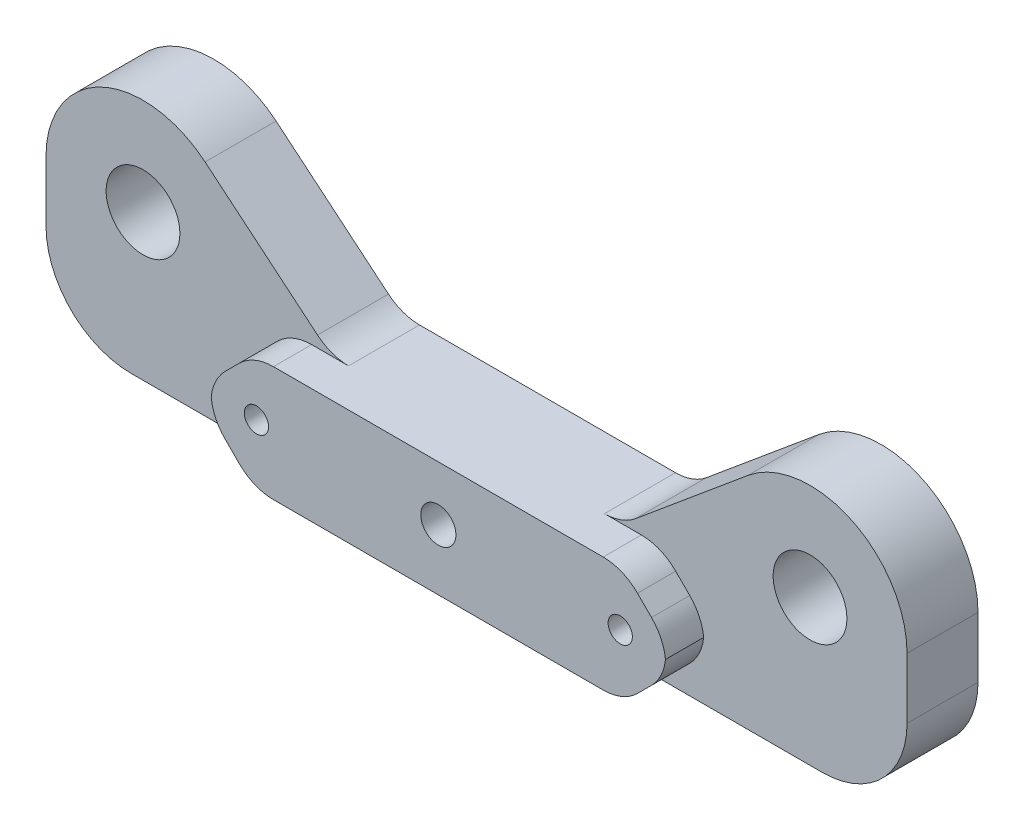
ISO-10303-21;
HEADER;
FILE_DESCRIPTION(('STEP AP214'),'2;1');
FILE_NAME('part.step','',(''),(''),'','','');
FILE_SCHEMA(('AUTOMOTIVE_DESIGN { 1 0 10303 214 1 1 1 1 }'));
ENDSEC;
DATA;
#1=APPLICATION_CONTEXT('core data for automotive mechanical design processes');
#2=APPLICATION_PROTOCOL_DEFINITION('international standard','automotive_design',2000,#1);
#3=PRODUCT_CONTEXT('',#1,'mechanical');
#4=PRODUCT('Part','Part','',(#3));
#5=PRODUCT_RELATED_PRODUCT_CATEGORY('part','',(#4));
#6=PRODUCT_DEFINITION_FORMATION('','',#4);
#7=PRODUCT_DEFINITION_CONTEXT('part definition',#1,'design');
#8=PRODUCT_DEFINITION('design','',#6,#7);
#9=PRODUCT_DEFINITION_SHAPE('','',#8);
#10=(LENGTH_UNIT() NAMED_UNIT(*) SI_UNIT(.MILLI.,.METRE.));
#11=(NAMED_UNIT(*) PLANE_ANGLE_UNIT() SI_UNIT($,.RADIAN.));
#12=(NAMED_UNIT(*) SI_UNIT($,.STERADIAN.) SOLID_ANGLE_UNIT());
#13=UNCERTAINTY_MEASURE_WITH_UNIT(LENGTH_MEASURE(1.E-05),#10,'distance_accuracy_value','');
#14=(GEOMETRIC_REPRESENTATION_CONTEXT(3) GLOBAL_UNCERTAINTY_ASSIGNED_CONTEXT((#13)) GLOBAL_UNIT_ASSIGNED_CONTEXT((#10,
#11,#12)) REPRESENTATION_CONTEXT('',''));
#15=CARTESIAN_POINT('',(0.,0.,0.));
#16=DIRECTION('',(0.,0.,1.));
#17=DIRECTION('',(1.,0.,0.));
#18=AXIS2_PLACEMENT_3D('',#15,#16,#17);
#19=CARTESIAN_POINT('',(15.,0.,-9.));
#20=DIRECTION('',(0.,0.,-1.));
#21=DIRECTION('',(1.,0.,0.));
#22=AXIS2_PLACEMENT_3D('',#19,#20,#21);
#23=CYLINDRICAL_SURFACE('',#22,0.999999999999997);
#24=CARTESIAN_POINT('',(15.,0.,0.));
#25=DIRECTION('',(0.,0.,-1.));
#26=DIRECTION('',(-1.,0.,0.));
#27=AXIS2_PLACEMENT_3D('',#24,#25,#26);
#28=CIRCLE('',#27,0.999999999999997);
#29=CARTESIAN_POINT('',(14.,0.,0.));
#30=VERTEX_POINT('',#29);
#31=EDGE_CURVE('E293',#30,#30,#28,.T.);
#32=ORIENTED_EDGE('',*,*,#31,.F.);
#33=EDGE_LOOP('',(#32));
#34=FACE_BOUND('',#33,.T.);
#35=CARTESIAN_POINT('',(15.,0.,-7.));
#36=DIRECTION('',(0.,0.,1.));
#37=DIRECTION('',(1.,0.,0.));
#38=AXIS2_PLACEMENT_3D('',#35,#36,#37);
#39=CIRCLE('',#38,0.999999999999997);
#40=CARTESIAN_POINT('',(16.,0.,-7.));
#41=VERTEX_POINT('',#40);
#42=EDGE_CURVE('E335',#41,#41,#39,.F.);
#43=ORIENTED_EDGE('',*,*,#42,.T.);
#44=EDGE_LOOP('',(#43));
#45=FACE_BOUND('',#44,.T.);
#46=ADVANCED_FACE('F39',(#34,#45),#23,.F.);
#47=CARTESIAN_POINT('',(-15.,0.,-9.));
#48=DIRECTION('',(0.,0.,-1.));
#49=DIRECTION('',(1.,0.,0.));
#50=AXIS2_PLACEMENT_3D('',#47,#48,#49);
#51=CYLINDRICAL_SURFACE('',#50,0.999999999999994);
#52=CARTESIAN_POINT('',(-15.,0.,0.));
#53=DIRECTION('',(0.,0.,-1.));
#54=DIRECTION('',(-1.,0.,0.));
#55=AXIS2_PLACEMENT_3D('',#52,#53,#54);
#56=CIRCLE('',#55,0.999999999999994);
#57=CARTESIAN_POINT('',(-16.,0.,0.));
#58=VERTEX_POINT('',#57);
#59=EDGE_CURVE('E296',#58,#58,#56,.T.);
#60=ORIENTED_EDGE('',*,*,#59,.F.);
#61=EDGE_LOOP('',(#60));
#62=FACE_BOUND('',#61,.T.);
#63=CARTESIAN_POINT('',(-15.,0.,-7.));
#64=DIRECTION('',(0.,0.,1.));
#65=DIRECTION('',(1.,0.,0.));
#66=AXIS2_PLACEMENT_3D('',#63,#64,#65);
#67=CIRCLE('',#66,0.999999999999994);
#68=CARTESIAN_POINT('',(-14.,0.,-7.));
#69=VERTEX_POINT('',#68);
#70=EDGE_CURVE('E332',#69,#69,#67,.F.);
#71=ORIENTED_EDGE('',*,*,#70,.T.);
#72=EDGE_LOOP('',(#71));
#73=FACE_BOUND('',#72,.T.);
#74=ADVANCED_FACE('F539',(#62,#73),#51,.F.);
#75=CARTESIAN_POINT('',(33.75,-3.5,-3.15));
#76=DIRECTION('',(0.,0.,-1.));
#77=DIRECTION('',(1.,0.,0.));
#78=AXIS2_PLACEMENT_3D('',#75,#76,#77);
#79=PLANE('',#78);
#80=DIRECTION('',(0.,-1.,0.));
#81=VECTOR('',#80,1.);
#82=CARTESIAN_POINT('',(35.5,7.,-3.15000000000001));
#83=LINE('',#82,#81);
#84=CARTESIAN_POINT('',(35.5,7.,-3.15000000000001));
#85=VERTEX_POINT('',#84);
#86=CARTESIAN_POINT('',(35.5,2.,-3.15000000000001));
#87=VERTEX_POINT('',#86);
#88=EDGE_CURVE('E454',#85,#87,#83,.T.);
#89=ORIENTED_EDGE('',*,*,#88,.F.);
#90=CARTESIAN_POINT('',(27.5,7.,-3.15));
#91=DIRECTION('',(0.,0.,-1.));
#92=DIRECTION('',(-1.,0.,0.));
#93=AXIS2_PLACEMENT_3D('',#90,#91,#92);
#94=CIRCLE('',#93,8.);
#95=CARTESIAN_POINT('',(22.3795735427094,13.1466440352015,-3.15));
#96=VERTEX_POINT('',#95);
#97=EDGE_CURVE('E250',#96,#85,#94,.T.);
#98=ORIENTED_EDGE('',*,*,#97,.F.);
#99=DIRECTION('',(0.768330504400193,0.640053307161321,0.));
#100=VECTOR('',#99,1.);
#101=CARTESIAN_POINT('',(22.3795735427094,13.1466440352015,-3.15));
#102=LINE('',#101,#100);
#103=CARTESIAN_POINT('',(13.1123994730862,5.42667798239923,-3.14999999999999));
#104=VERTEX_POINT('',#103);
#105=EDGE_CURVE('E235',#104,#96,#102,.T.);
#106=ORIENTED_EDGE('',*,*,#105,.F.);
#107=CARTESIAN_POINT('',(10.5521862444409,8.5,-3.14999999999999));
#108=DIRECTION('',(0.,0.,1.));
#109=DIRECTION('',(1.,0.,0.));
#110=AXIS2_PLACEMENT_3D('',#107,#108,#109);
#111=CIRCLE('',#110,4.);
#112=CARTESIAN_POINT('',(10.5521862444409,4.5,-3.14999999999999));
#113=VERTEX_POINT('',#112);
#114=EDGE_CURVE('E350',#113,#104,#111,.T.);
#115=ORIENTED_EDGE('',*,*,#114,.F.);
#116=DIRECTION('',(-1.,0.,0.));
#117=VECTOR('',#116,1.);
#118=CARTESIAN_POINT('',(18.75,4.5,-3.15));
#119=LINE('',#118,#117);
#120=CARTESIAN_POINT('',(13.5931457505076,4.5,-3.14999999999999));
#121=VERTEX_POINT('',#120);
#122=EDGE_CURVE('E303',#121,#113,#119,.T.);
#123=ORIENTED_EDGE('',*,*,#122,.F.);
#124=CARTESIAN_POINT('',(13.5931457505076,0.500000000000002,-3.14999999999999));
#125=DIRECTION('',(0.,0.,1.));
#126=DIRECTION('',(1.,0.,0.));
#127=AXIS2_PLACEMENT_3D('',#124,#125,#126);
#128=CIRCLE('',#127,4.);
#129=CARTESIAN_POINT('',(16.4215728752538,3.32842712474619,-3.14999999999999));
#130=VERTEX_POINT('',#129);
#131=EDGE_CURVE('E11',#130,#121,#128,.T.);
#132=ORIENTED_EDGE('',*,*,#131,.F.);
#133=DIRECTION('',(-0.707106781186547,0.707106781186548,0.));
#134=VECTOR('',#133,1.);
#135=CARTESIAN_POINT('',(28.5,-8.75000000000001,-3.15));
#136=LINE('',#135,#134);
#137=CARTESIAN_POINT('',(17.5784271247462,2.1715728752538,-3.15));
#138=VERTEX_POINT('',#137);
#139=EDGE_CURVE('E329',#138,#130,#136,.T.);
#140=ORIENTED_EDGE('',*,*,#139,.F.);
#141=CARTESIAN_POINT('',(14.75,-0.656854249492387,-3.14999999999999));
#142=DIRECTION('',(0.,0.,1.));
#143=DIRECTION('',(1.,0.,0.));
#144=AXIS2_PLACEMENT_3D('',#141,#142,#143);
#145=CIRCLE('',#144,4.);
#146=CARTESIAN_POINT('',(18.7292549076014,-0.249999999999993,-3.15));
#147=VERTEX_POINT('',#146);
#148=EDGE_CURVE('E48',#147,#138,#145,.T.);
#149=ORIENTED_EDGE('',*,*,#148,.F.);
#150=CARTESIAN_POINT('',(14.75,0.156854249492402,-3.14999999999999));
#151=DIRECTION('',(0.,0.,1.));
#152=DIRECTION('',(1.,0.,0.));
#153=AXIS2_PLACEMENT_3D('',#150,#151,#152);
#154=CIRCLE('',#153,4.);
#155=CARTESIAN_POINT('',(17.5784271247462,-2.67157287525378,-3.15));
#156=VERTEX_POINT('',#155);
#157=EDGE_CURVE('E435',#156,#147,#154,.T.);
#158=ORIENTED_EDGE('',*,*,#157,.F.);
#159=DIRECTION('',(0.707106781186546,0.707106781186549,0.));
#160=VECTOR('',#159,1.);
#161=CARTESIAN_POINT('',(25.25,5.00000000000001,-3.15));
#162=LINE('',#161,#160);
#163=CARTESIAN_POINT('',(16.4215728752538,-3.82842712474618,-3.14999999999999));
#164=VERTEX_POINT('',#163);
#165=EDGE_CURVE('E323',#164,#156,#162,.T.);
#166=ORIENTED_EDGE('',*,*,#165,.F.);
#167=CARTESIAN_POINT('',(13.5931457505076,-0.999999999999997,-3.14999999999999));
#168=DIRECTION('',(0.,0.,1.));
#169=DIRECTION('',(1.,0.,0.));
#170=AXIS2_PLACEMENT_3D('',#167,#168,#169);
#171=CIRCLE('',#170,4.);
#172=CARTESIAN_POINT('',(13.5931457505076,-5.,-3.14999999999999));
#173=VERTEX_POINT('',#172);
#174=EDGE_CURVE('E432',#173,#164,#171,.T.);
#175=ORIENTED_EDGE('',*,*,#174,.F.);
#176=DIRECTION('',(1.,0.,0.));
#177=VECTOR('',#176,1.);
#178=CARTESIAN_POINT('',(18.75,-5.,-3.15));
#179=LINE('',#178,#177);
#180=CARTESIAN_POINT('',(28.5,-5.,-3.15));
#181=VERTEX_POINT('',#180);
#182=EDGE_CURVE('E279',#173,#181,#179,.T.);
#183=ORIENTED_EDGE('',*,*,#182,.T.);
#184=CARTESIAN_POINT('',(28.5,2.,-3.15));
#185=DIRECTION('',(0.,0.,1.));
#186=DIRECTION('',(1.,0.,0.));
#187=AXIS2_PLACEMENT_3D('',#184,#185,#186);
#188=CIRCLE('',#187,7.);
#189=EDGE_CURVE('E358',#87,#181,#188,.F.);
#190=ORIENTED_EDGE('',*,*,#189,.F.);
#191=EDGE_LOOP('',(#89,#98,#106,#115,#123,#132,#140,#149,#158,#166,#175,#183,#190));
#192=FACE_BOUND('',#191,.T.);
#193=CARTESIAN_POINT('',(27.5,7.,-3.15));
#194=DIRECTION('',(0.,0.,1.));
#195=DIRECTION('',(1.,0.,0.));
#196=AXIS2_PLACEMENT_3D('',#193,#194,#195);
#197=CIRCLE('',#196,3.04);
#198=CARTESIAN_POINT('',(30.54,7.,-3.15));
#199=VERTEX_POINT('',#198);
#200=EDGE_CURVE('E299',#199,#199,#197,.F.);
#201=ORIENTED_EDGE('',*,*,#200,.T.);
#202=EDGE_LOOP('',(#201));
#203=FACE_BOUND('',#202,.T.);
#204=ADVANCED_FACE('F503',(#192,#203),#79,.F.);
#205=CARTESIAN_POINT('',(-33.75,3.5,-9.));
#206=DIRECTION('',(0.,0.,-1.));
#207=DIRECTION('',(1.,0.,0.));
#208=AXIS2_PLACEMENT_3D('',#205,#206,#207);
#209=PLANE('',#208);
#210=DIRECTION('',(-1.,0.,0.));
#211=VECTOR('',#210,1.);
#212=CARTESIAN_POINT('',(33.75,-5.,-9.));
#213=LINE('',#212,#211);
#214=CARTESIAN_POINT('',(28.5,-5.,-9.));
#215=VERTEX_POINT('',#214);
#216=CARTESIAN_POINT('',(-28.5,-5.,-9.));
#217=VERTEX_POINT('',#216);
#218=EDGE_CURVE('E282',#215,#217,#213,.T.);
#219=ORIENTED_EDGE('',*,*,#218,.T.);
#220=CARTESIAN_POINT('',(-28.5,2.,-9.));
#221=DIRECTION('',(0.,0.,1.));
#222=DIRECTION('',(1.,0.,0.));
#223=AXIS2_PLACEMENT_3D('',#220,#221,#222);
#224=CIRCLE('',#223,7.);
#225=CARTESIAN_POINT('',(-35.5,2.,-9.));
#226=VERTEX_POINT('',#225);
#227=EDGE_CURVE('E365',#226,#217,#224,.T.);
#228=ORIENTED_EDGE('',*,*,#227,.F.);
#229=DIRECTION('',(0.,1.,0.));
#230=VECTOR('',#229,1.);
#231=CARTESIAN_POINT('',(-35.5,7.,-9.));
#232=LINE('',#231,#230);
#233=CARTESIAN_POINT('',(-35.5,7.,-9.));
#234=VERTEX_POINT('',#233);
#235=EDGE_CURVE('E242',#226,#234,#232,.T.);
#236=ORIENTED_EDGE('',*,*,#235,.T.);
#237=CARTESIAN_POINT('',(-27.5,7.,-9.));
#238=DIRECTION('',(0.,0.,1.));
#239=DIRECTION('',(1.,0.,0.));
#240=AXIS2_PLACEMENT_3D('',#237,#238,#239);
#241=CIRCLE('',#240,8.);
#242=CARTESIAN_POINT('',(-22.3795735427095,13.1466440352015,-9.));
#243=VERTEX_POINT('',#242);
#244=EDGE_CURVE('E219',#234,#243,#241,.F.);
#245=ORIENTED_EDGE('',*,*,#244,.T.);
#246=DIRECTION('',(0.768330504400194,-0.640053307161321,0.));
#247=VECTOR('',#246,1.);
#248=CARTESIAN_POINT('',(-22.3795735427095,13.1466440352016,-9.));
#249=LINE('',#248,#247);
#250=CARTESIAN_POINT('',(-13.1123994730862,5.42667798239922,-9.));
#251=VERTEX_POINT('',#250);
#252=EDGE_CURVE('E226',#243,#251,#249,.T.);
#253=ORIENTED_EDGE('',*,*,#252,.T.);
#254=CARTESIAN_POINT('',(-10.5521862444409,8.5,-9.));
#255=DIRECTION('',(0.,0.,1.));
#256=DIRECTION('',(1.,0.,0.));
#257=AXIS2_PLACEMENT_3D('',#254,#255,#256);
#258=CIRCLE('',#257,4.);
#259=CARTESIAN_POINT('',(-10.5521862444409,4.5,-9.));
#260=VERTEX_POINT('',#259);
#261=EDGE_CURVE('E348',#260,#251,#258,.F.);
#262=ORIENTED_EDGE('',*,*,#261,.F.);
#263=DIRECTION('',(1.,0.,0.));
#264=VECTOR('',#263,1.);
#265=CARTESIAN_POINT('',(-21.25,4.5,-9.));
#266=LINE('',#265,#264);
#267=CARTESIAN_POINT('',(10.5521862444409,4.5,-9.));
#268=VERTEX_POINT('',#267);
#269=EDGE_CURVE('E261',#260,#268,#266,.T.);
#270=ORIENTED_EDGE('',*,*,#269,.T.);
#271=CARTESIAN_POINT('',(10.5521862444409,8.5,-9.));
#272=DIRECTION('',(0.,0.,1.));
#273=DIRECTION('',(1.,0.,0.));
#274=AXIS2_PLACEMENT_3D('',#271,#272,#273);
#275=CIRCLE('',#274,4.);
#276=CARTESIAN_POINT('',(13.1123994730862,5.42667798239923,-9.));
#277=VERTEX_POINT('',#276);
#278=EDGE_CURVE('E353',#277,#268,#275,.F.);
#279=ORIENTED_EDGE('',*,*,#278,.F.);
#280=DIRECTION('',(0.768330504400193,0.640053307161321,0.));
#281=VECTOR('',#280,1.);
#282=CARTESIAN_POINT('',(22.3795735427094,13.1466440352015,-9.));
#283=LINE('',#282,#281);
#284=CARTESIAN_POINT('',(22.3795735427094,13.1466440352015,-9.));
#285=VERTEX_POINT('',#284);
#286=EDGE_CURVE('E443',#277,#285,#283,.T.);
#287=ORIENTED_EDGE('',*,*,#286,.T.);
#288=CARTESIAN_POINT('',(27.5,7.,-9.));
#289=DIRECTION('',(0.,0.,1.));
#290=DIRECTION('',(1.,0.,0.));
#291=AXIS2_PLACEMENT_3D('',#288,#289,#290);
#292=CIRCLE('',#291,8.);
#293=CARTESIAN_POINT('',(35.5,7.,-9.));
#294=VERTEX_POINT('',#293);
#295=EDGE_CURVE('E245',#285,#294,#292,.F.);
#296=ORIENTED_EDGE('',*,*,#295,.T.);
#297=DIRECTION('',(0.,-1.,0.));
#298=VECTOR('',#297,1.);
#299=CARTESIAN_POINT('',(35.5,7.,-9.));
#300=LINE('',#299,#298);
#301=CARTESIAN_POINT('',(35.5,2.,-9.));
#302=VERTEX_POINT('',#301);
#303=EDGE_CURVE('E247',#294,#302,#300,.T.);
#304=ORIENTED_EDGE('',*,*,#303,.T.);
#305=CARTESIAN_POINT('',(28.5,2.,-9.));
#306=DIRECTION('',(0.,0.,1.));
#307=DIRECTION('',(1.,0.,0.));
#308=AXIS2_PLACEMENT_3D('',#305,#306,#307);
#309=CIRCLE('',#308,7.);
#310=EDGE_CURVE('E368',#215,#302,#309,.T.);
#311=ORIENTED_EDGE('',*,*,#310,.F.);
#312=EDGE_LOOP('',(#219,#228,#236,#245,#253,#262,#270,#279,#287,#296,#304,#311));
#313=FACE_BOUND('',#312,.T.);
#314=CARTESIAN_POINT('',(0.,0.,-9.));
#315=DIRECTION('',(0.,0.,1.));
#316=DIRECTION('',(1.,0.,0.));
#317=AXIS2_PLACEMENT_3D('',#314,#315,#316);
#318=CIRCLE('',#317,2.75);
#319=CARTESIAN_POINT('',(2.75,0.,-9.));
#320=VERTEX_POINT('',#319);
#321=EDGE_CURVE('E264',#320,#320,#318,.T.);
#322=ORIENTED_EDGE('',*,*,#321,.T.);
#323=EDGE_LOOP('',(#322));
#324=FACE_BOUND('',#323,.T.);
#325=CARTESIAN_POINT('',(27.5,7.,-9.));
#326=DIRECTION('',(0.,0.,1.));
#327=DIRECTION('',(1.,0.,0.));
#328=AXIS2_PLACEMENT_3D('',#325,#326,#327);
#329=CIRCLE('',#328,3.04);
#330=CARTESIAN_POINT('',(30.54,7.,-9.));
#331=VERTEX_POINT('',#330);
#332=EDGE_CURVE('E290',#331,#331,#329,.F.);
#333=ORIENTED_EDGE('',*,*,#332,.F.);
#334=EDGE_LOOP('',(#333));
#335=FACE_BOUND('',#334,.T.);
#336=CARTESIAN_POINT('',(-27.5,7.,-9.));
#337=DIRECTION('',(0.,0.,1.));
#338=DIRECTION('',(1.,0.,0.));
#339=AXIS2_PLACEMENT_3D('',#336,#337,#338);
#340=CIRCLE('',#339,3.04);
#341=CARTESIAN_POINT('',(-24.46,7.,-9.));
#342=VERTEX_POINT('',#341);
#343=EDGE_CURVE('E287',#342,#342,#340,.T.);
#344=ORIENTED_EDGE('',*,*,#343,.T.);
#345=EDGE_LOOP('',(#344));
#346=FACE_BOUND('',#345,.T.);
#347=ADVANCED_FACE('F238',(#313,#324,#335,#346),#209,.T.);
#348=CARTESIAN_POINT('',(-27.5,7.,-22.));
#349=DIRECTION('',(0.,0.,1.));
#350=DIRECTION('',(-1.,0.,0.));
#351=AXIS2_PLACEMENT_3D('',#348,#349,#350);
#352=CYLINDRICAL_SURFACE('',#351,3.04);
#353=CARTESIAN_POINT('',(-27.5,7.,-3.15));
#354=DIRECTION('',(0.,0.,1.));
#355=DIRECTION('',(1.,0.,0.));
#356=AXIS2_PLACEMENT_3D('',#353,#354,#355);
#357=CIRCLE('',#356,3.04);
#358=CARTESIAN_POINT('',(-24.46,7.,-3.15));
#359=VERTEX_POINT('',#358);
#360=EDGE_CURVE('E300',#359,#359,#357,.F.);
#361=ORIENTED_EDGE('',*,*,#360,.F.);
#362=EDGE_LOOP('',(#361));
#363=FACE_BOUND('',#362,.T.);
#364=ORIENTED_EDGE('',*,*,#343,.F.);
#365=EDGE_LOOP('',(#364));
#366=FACE_BOUND('',#365,.T.);
#367=ADVANCED_FACE('F558',(#363,#366),#352,.F.);
#368=CARTESIAN_POINT('',(27.5,7.,-22.));
#369=DIRECTION('',(0.,0.,1.));
#370=DIRECTION('',(-1.,0.,0.));
#371=AXIS2_PLACEMENT_3D('',#368,#369,#370);
#372=CYLINDRICAL_SURFACE('',#371,3.04);
#373=ORIENTED_EDGE('',*,*,#200,.F.);
#374=EDGE_LOOP('',(#373));
#375=FACE_BOUND('',#374,.T.);
#376=ORIENTED_EDGE('',*,*,#332,.T.);
#377=EDGE_LOOP('',(#376));
#378=FACE_BOUND('',#377,.T.);
#379=ADVANCED_FACE('F555',(#375,#378),#372,.F.);
#380=CARTESIAN_POINT('',(-33.75,-3.50000000000001,-3.15));
#381=DIRECTION('',(0.,0.,-1.));
#382=DIRECTION('',(1.,0.,0.));
#383=AXIS2_PLACEMENT_3D('',#380,#381,#382);
#384=PLANE('',#383);
#385=DIRECTION('',(1.,0.,0.));
#386=VECTOR('',#385,1.);
#387=CARTESIAN_POINT('',(-33.75,-5.,-3.15));
#388=LINE('',#387,#386);
#389=CARTESIAN_POINT('',(-28.5,-5.,-3.15));
#390=VERTEX_POINT('',#389);
#391=CARTESIAN_POINT('',(-13.5931457505076,-5.,-3.15000000000001));
#392=VERTEX_POINT('',#391);
#393=EDGE_CURVE('E284',#390,#392,#388,.T.);
#394=ORIENTED_EDGE('',*,*,#393,.T.);
#395=CARTESIAN_POINT('',(-13.5931457505076,-1.,-3.15));
#396=DIRECTION('',(0.,0.,1.));
#397=DIRECTION('',(1.,0.,0.));
#398=AXIS2_PLACEMENT_3D('',#395,#396,#397);
#399=CIRCLE('',#398,4.);
#400=CARTESIAN_POINT('',(-16.4215728752538,-3.82842712474619,-3.15));
#401=VERTEX_POINT('',#400);
#402=EDGE_CURVE('E429',#401,#392,#399,.T.);
#403=ORIENTED_EDGE('',*,*,#402,.F.);
#404=DIRECTION('',(0.707106781186547,-0.707106781186548,0.));
#405=VECTOR('',#404,1.);
#406=CARTESIAN_POINT('',(-25.25,5.,-3.15));
#407=LINE('',#406,#405);
#408=CARTESIAN_POINT('',(-17.5784271247462,-2.6715728752538,-3.15));
#409=VERTEX_POINT('',#408);
#410=EDGE_CURVE('E320',#409,#401,#407,.T.);
#411=ORIENTED_EDGE('',*,*,#410,.F.);
#412=CARTESIAN_POINT('',(-14.75,0.156854249492389,-3.15));
#413=DIRECTION('',(0.,0.,1.));
#414=DIRECTION('',(1.,0.,0.));
#415=AXIS2_PLACEMENT_3D('',#412,#413,#414);
#416=CIRCLE('',#415,4.);
#417=CARTESIAN_POINT('',(-18.7292549076014,-0.250000000000006,-3.15));
#418=VERTEX_POINT('',#417);
#419=EDGE_CURVE('E422',#418,#409,#416,.T.);
#420=ORIENTED_EDGE('',*,*,#419,.F.);
#421=CARTESIAN_POINT('',(-14.75,-0.656854249492401,-3.15));
#422=DIRECTION('',(0.,0.,1.));
#423=DIRECTION('',(1.,0.,0.));
#424=AXIS2_PLACEMENT_3D('',#421,#422,#423);
#425=CIRCLE('',#424,4.);
#426=CARTESIAN_POINT('',(-17.5784271247462,2.17157287525378,-3.15));
#427=VERTEX_POINT('',#426);
#428=EDGE_CURVE('E424',#427,#418,#425,.T.);
#429=ORIENTED_EDGE('',*,*,#428,.F.);
#430=DIRECTION('',(-0.707106781186546,-0.707106781186549,0.));
#431=VECTOR('',#430,1.);
#432=CARTESIAN_POINT('',(-28.5,-8.75000000000003,-3.15));
#433=LINE('',#432,#431);
#434=CARTESIAN_POINT('',(-16.4215728752538,3.32842712474619,-3.15));
#435=VERTEX_POINT('',#434);
#436=EDGE_CURVE('E326',#435,#427,#433,.T.);
#437=ORIENTED_EDGE('',*,*,#436,.F.);
#438=CARTESIAN_POINT('',(-13.5931457505076,0.499999999999999,-3.15));
#439=DIRECTION('',(0.,0.,1.));
#440=DIRECTION('',(1.,0.,0.));
#441=AXIS2_PLACEMENT_3D('',#438,#439,#440);
#442=CIRCLE('',#441,4.);
#443=CARTESIAN_POINT('',(-13.5931457505076,4.5,-3.14999999999998));
#444=VERTEX_POINT('',#443);
#445=EDGE_CURVE('E426',#444,#435,#442,.T.);
#446=ORIENTED_EDGE('',*,*,#445,.F.);
#447=DIRECTION('',(-1.,0.,0.));
#448=VECTOR('',#447,1.);
#449=CARTESIAN_POINT('',(-12.,4.5,-3.14999999999998));
#450=LINE('',#449,#448);
#451=CARTESIAN_POINT('',(-10.5521862444409,4.5,-3.14999999999998));
#452=VERTEX_POINT('',#451);
#453=EDGE_CURVE('E253',#452,#444,#450,.T.);
#454=ORIENTED_EDGE('',*,*,#453,.F.);
#455=CARTESIAN_POINT('',(-10.5521862444409,8.5,-3.15));
#456=DIRECTION('',(0.,0.,1.));
#457=DIRECTION('',(1.,0.,0.));
#458=AXIS2_PLACEMENT_3D('',#455,#456,#457);
#459=CIRCLE('',#458,4.);
#460=CARTESIAN_POINT('',(-13.1123994730862,5.42667798239923,-3.14999999999998));
#461=VERTEX_POINT('',#460);
#462=EDGE_CURVE('E345',#461,#452,#459,.T.);
#463=ORIENTED_EDGE('',*,*,#462,.F.);
#464=DIRECTION('',(0.768330504400193,-0.640053307161321,0.));
#465=VECTOR('',#464,1.);
#466=CARTESIAN_POINT('',(-22.3795735427094,13.1466440352015,-3.14999999999997));
#467=LINE('',#466,#465);
#468=CARTESIAN_POINT('',(-22.3795735427095,13.1466440352015,-3.14999999999997));
#469=VERTEX_POINT('',#468);
#470=EDGE_CURVE('E227',#469,#461,#467,.T.);
#471=ORIENTED_EDGE('',*,*,#470,.F.);
#472=CARTESIAN_POINT('',(-27.5,7.,-3.14999999999997));
#473=DIRECTION('',(0.,0.,-1.));
#474=DIRECTION('',(1.,0.,0.));
#475=AXIS2_PLACEMENT_3D('',#472,#473,#474);
#476=CIRCLE('',#475,8.);
#477=CARTESIAN_POINT('',(-35.5,7.,-3.14999999999996));
#478=VERTEX_POINT('',#477);
#479=EDGE_CURVE('E222',#478,#469,#476,.T.);
#480=ORIENTED_EDGE('',*,*,#479,.F.);
#481=DIRECTION('',(0.,1.,0.));
#482=VECTOR('',#481,1.);
#483=CARTESIAN_POINT('',(-35.5,7.,-3.14999999999996));
#484=LINE('',#483,#482);
#485=CARTESIAN_POINT('',(-35.5,2.,-3.14999999999996));
#486=VERTEX_POINT('',#485);
#487=EDGE_CURVE('E448',#486,#478,#484,.T.);
#488=ORIENTED_EDGE('',*,*,#487,.F.);
#489=CARTESIAN_POINT('',(-28.5,2.,-3.15));
#490=DIRECTION('',(0.,0.,1.));
#491=DIRECTION('',(1.,0.,0.));
#492=AXIS2_PLACEMENT_3D('',#489,#490,#491);
#493=CIRCLE('',#492,7.);
#494=EDGE_CURVE('E371',#390,#486,#493,.F.);
#495=ORIENTED_EDGE('',*,*,#494,.F.);
#496=EDGE_LOOP('',(#394,#403,#411,#420,#429,#437,#446,#454,#463,#471,#480,#488,#495));
#497=FACE_BOUND('',#496,.T.);
#498=ORIENTED_EDGE('',*,*,#360,.T.);
#499=EDGE_LOOP('',(#498));
#500=FACE_BOUND('',#499,.T.);
#501=ADVANCED_FACE('F480',(#497,#500),#384,.F.);
#502=CARTESIAN_POINT('',(15.,13.5,0.));
#503=DIRECTION('',(0.,0.,1.));
#504=DIRECTION('',(-1.,0.,0.));
#505=AXIS2_PLACEMENT_3D('',#502,#503,#504);
#506=PLANE('',#505);
#507=CARTESIAN_POINT('',(0.,0.,0.));
#508=DIRECTION('',(0.,0.,1.));
#509=DIRECTION('',(1.,0.,0.));
#510=AXIS2_PLACEMENT_3D('',#507,#508,#509);
#511=CIRCLE('',#510,1.45);
#512=CARTESIAN_POINT('',(1.45,0.,0.));
#513=VERTEX_POINT('',#512);
#514=EDGE_CURVE('E273',#513,#513,#511,.T.);
#515=ORIENTED_EDGE('',*,*,#514,.F.);
#516=EDGE_LOOP('',(#515));
#517=FACE_BOUND('',#516,.T.);
#518=ORIENTED_EDGE('',*,*,#31,.T.);
#519=EDGE_LOOP('',(#518));
#520=FACE_BOUND('',#519,.T.);
#521=ORIENTED_EDGE('',*,*,#59,.T.);
#522=EDGE_LOOP('',(#521));
#523=FACE_BOUND('',#522,.T.);
#524=DIRECTION('',(-0.707106781186547,0.707106781186548,0.));
#525=VECTOR('',#524,1.);
#526=CARTESIAN_POINT('',(-9.37500000000004,-10.875,0.));
#527=LINE('',#526,#525);
#528=CARTESIAN_POINT('',(-16.4215728752538,-3.82842712474619,0.));
#529=VERTEX_POINT('',#528);
#530=CARTESIAN_POINT('',(-17.5784271247462,-2.6715728752538,0.));
#531=VERTEX_POINT('',#530);
#532=EDGE_CURVE('E317',#529,#531,#527,.T.);
#533=ORIENTED_EDGE('',*,*,#532,.F.);
#534=CARTESIAN_POINT('',(-13.5931457505076,-1.,0.));
#535=DIRECTION('',(0.,0.,-1.));
#536=DIRECTION('',(-1.,0.,0.));
#537=AXIS2_PLACEMENT_3D('',#534,#535,#536);
#538=CIRCLE('',#537,4.);
#539=CARTESIAN_POINT('',(-13.5931457505076,-5.,0.));
#540=VERTEX_POINT('',#539);
#541=EDGE_CURVE('E391',#540,#529,#538,.T.);
#542=ORIENTED_EDGE('',*,*,#541,.F.);
#543=DIRECTION('',(1.,0.,0.));
#544=VECTOR('',#543,1.);
#545=CARTESIAN_POINT('',(-18.75,-5.,0.));
#546=LINE('',#545,#544);
#547=CARTESIAN_POINT('',(13.5931457505076,-5.,0.));
#548=VERTEX_POINT('',#547);
#549=EDGE_CURVE('E276',#540,#548,#546,.T.);
#550=ORIENTED_EDGE('',*,*,#549,.T.);
#551=CARTESIAN_POINT('',(13.5931457505076,-0.999999999999997,0.));
#552=DIRECTION('',(0.,0.,-1.));
#553=DIRECTION('',(-1.,0.,0.));
#554=AXIS2_PLACEMENT_3D('',#551,#552,#553);
#555=CIRCLE('',#554,4.);
#556=CARTESIAN_POINT('',(16.4215728752538,-3.82842712474618,0.));
#557=VERTEX_POINT('',#556);
#558=EDGE_CURVE('E388',#557,#548,#555,.T.);
#559=ORIENTED_EDGE('',*,*,#558,.F.);
#560=DIRECTION('',(-0.707106781186546,-0.707106781186549,0.));
#561=VECTOR('',#560,1.);
#562=CARTESIAN_POINT('',(24.375,4.12500000000003,0.));
#563=LINE('',#562,#561);
#564=CARTESIAN_POINT('',(17.5784271247462,-2.67157287525378,0.));
#565=VERTEX_POINT('',#564);
#566=EDGE_CURVE('E314',#565,#557,#563,.T.);
#567=ORIENTED_EDGE('',*,*,#566,.F.);
#568=CARTESIAN_POINT('',(14.75,0.156854249492402,0.));
#569=DIRECTION('',(0.,0.,-1.));
#570=DIRECTION('',(-1.,0.,0.));
#571=AXIS2_PLACEMENT_3D('',#568,#569,#570);
#572=CIRCLE('',#571,4.);
#573=CARTESIAN_POINT('',(18.7292549076014,-0.249999999999993,0.));
#574=VERTEX_POINT('',#573);
#575=EDGE_CURVE('E385',#574,#565,#572,.T.);
#576=ORIENTED_EDGE('',*,*,#575,.F.);
#577=CARTESIAN_POINT('',(14.75,-0.656854249492387,0.));
#578=DIRECTION('',(0.,0.,-1.));
#579=DIRECTION('',(-1.,0.,0.));
#580=AXIS2_PLACEMENT_3D('',#577,#578,#579);
#581=CIRCLE('',#580,4.);
#582=CARTESIAN_POINT('',(17.5784271247462,2.1715728752538,0.));
#583=VERTEX_POINT('',#582);
#584=EDGE_CURVE('E383',#583,#574,#581,.T.);
#585=ORIENTED_EDGE('',*,*,#584,.F.);
#586=DIRECTION('',(0.707106781186547,-0.707106781186548,0.));
#587=VECTOR('',#586,1.);
#588=CARTESIAN_POINT('',(10.625,9.12500000000002,0.));
#589=LINE('',#588,#587);
#590=CARTESIAN_POINT('',(16.4215728752538,3.32842712474619,0.));
#591=VERTEX_POINT('',#590);
#592=EDGE_CURVE('E308',#591,#583,#589,.T.);
#593=ORIENTED_EDGE('',*,*,#592,.F.);
#594=CARTESIAN_POINT('',(13.5931457505076,0.500000000000002,0.));
#595=DIRECTION('',(0.,0.,-1.));
#596=DIRECTION('',(-1.,0.,0.));
#597=AXIS2_PLACEMENT_3D('',#594,#595,#596);
#598=CIRCLE('',#597,4.);
#599=CARTESIAN_POINT('',(13.5931457505076,4.5,0.));
#600=VERTEX_POINT('',#599);
#601=EDGE_CURVE('E380',#600,#591,#598,.T.);
#602=ORIENTED_EDGE('',*,*,#601,.F.);
#603=DIRECTION('',(-1.,0.,0.));
#604=VECTOR('',#603,1.);
#605=CARTESIAN_POINT('',(18.75,4.5,0.));
#606=LINE('',#605,#604);
#607=CARTESIAN_POINT('',(-13.5931457505076,4.5,0.));
#608=VERTEX_POINT('',#607);
#609=EDGE_CURVE('E258',#600,#608,#606,.T.);
#610=ORIENTED_EDGE('',*,*,#609,.T.);
#611=CARTESIAN_POINT('',(-13.5931457505076,0.499999999999999,0.));
#612=DIRECTION('',(0.,0.,-1.));
#613=DIRECTION('',(-1.,0.,0.));
#614=AXIS2_PLACEMENT_3D('',#611,#612,#613);
#615=CIRCLE('',#614,4.);
#616=CARTESIAN_POINT('',(-16.4215728752538,3.32842712474618,0.));
#617=VERTEX_POINT('',#616);
#618=EDGE_CURVE('E394',#617,#608,#615,.T.);
#619=ORIENTED_EDGE('',*,*,#618,.F.);
#620=DIRECTION('',(0.707106781186546,0.707106781186549,0.));
#621=VECTOR('',#620,1.);
#622=CARTESIAN_POINT('',(4.37499999999994,24.125,0.));
#623=LINE('',#622,#621);
#624=CARTESIAN_POINT('',(-17.5784271247462,2.17157287525378,0.));
#625=VERTEX_POINT('',#624);
#626=EDGE_CURVE('E311',#625,#617,#623,.T.);
#627=ORIENTED_EDGE('',*,*,#626,.F.);
#628=CARTESIAN_POINT('',(-14.75,-0.656854249492401,0.));
#629=DIRECTION('',(0.,0.,-1.));
#630=DIRECTION('',(-1.,0.,0.));
#631=AXIS2_PLACEMENT_3D('',#628,#629,#630);
#632=CIRCLE('',#631,4.);
#633=CARTESIAN_POINT('',(-18.7292549076014,-0.250000000000006,0.));
#634=VERTEX_POINT('',#633);
#635=EDGE_CURVE('E397',#634,#625,#632,.T.);
#636=ORIENTED_EDGE('',*,*,#635,.F.);
#637=CARTESIAN_POINT('',(-14.75,0.156854249492389,0.));
#638=DIRECTION('',(0.,0.,-1.));
#639=DIRECTION('',(-1.,0.,0.));
#640=AXIS2_PLACEMENT_3D('',#637,#638,#639);
#641=CIRCLE('',#640,4.);
#642=EDGE_CURVE('E400',#531,#634,#641,.T.);
#643=ORIENTED_EDGE('',*,*,#642,.F.);
#644=EDGE_LOOP('',(#533,#542,#550,#559,#567,#576,#585,#593,#602,#610,#619,#627,#636,#643));
#645=FACE_BOUND('',#644,.T.);
#646=ADVANCED_FACE('F514',(#517,#520,#523,#645),#506,.T.);
#647=CARTESIAN_POINT('',(-18.75,-5.,0.));
#648=DIRECTION('',(0.,-1.,0.));
#649=DIRECTION('',(1.,0.,0.));
#650=AXIS2_PLACEMENT_3D('',#647,#648,#649);
#651=PLANE('',#650);
#652=ORIENTED_EDGE('',*,*,#393,.F.);
#653=DIRECTION('',(0.,0.,1.));
#654=VECTOR('',#653,1.);
#655=CARTESIAN_POINT('',(-28.5,-5.,0.));
#656=LINE('',#655,#654);
#657=EDGE_CURVE('E361',#217,#390,#656,.T.);
#658=ORIENTED_EDGE('',*,*,#657,.F.);
#659=ORIENTED_EDGE('',*,*,#218,.F.);
#660=DIRECTION('',(0.,0.,1.));
#661=VECTOR('',#660,1.);
#662=CARTESIAN_POINT('',(28.5,-5.,0.));
#663=LINE('',#662,#661);
#664=EDGE_CURVE('E363',#181,#215,#663,.F.);
#665=ORIENTED_EDGE('',*,*,#664,.F.);
#666=ORIENTED_EDGE('',*,*,#182,.F.);
#667=DIRECTION('',(0.,0.,-1.));
#668=VECTOR('',#667,1.);
#669=CARTESIAN_POINT('',(13.5931457505076,-5.,0.));
#670=LINE('',#669,#668);
#671=EDGE_CURVE('E410',#548,#173,#670,.T.);
#672=ORIENTED_EDGE('',*,*,#671,.F.);
#673=ORIENTED_EDGE('',*,*,#549,.F.);
#674=DIRECTION('',(0.,0.,1.));
#675=VECTOR('',#674,1.);
#676=CARTESIAN_POINT('',(-13.5931457505076,-5.,0.));
#677=LINE('',#676,#675);
#678=EDGE_CURVE('E412',#392,#540,#677,.T.);
#679=ORIENTED_EDGE('',*,*,#678,.F.);
#680=EDGE_LOOP('',(#652,#658,#659,#665,#666,#672,#673,#679));
#681=FACE_BOUND('',#680,.T.);
#682=ADVANCED_FACE('F471',(#681),#651,.T.);
#683=CARTESIAN_POINT('',(0.,0.,-9.));
#684=DIRECTION('',(0.,0.,-1.));
#685=DIRECTION('',(1.,0.,0.));
#686=AXIS2_PLACEMENT_3D('',#683,#684,#685);
#687=CYLINDRICAL_SURFACE('',#686,1.45);
#688=ORIENTED_EDGE('',*,*,#514,.T.);
#689=EDGE_LOOP('',(#688));
#690=FACE_BOUND('',#689,.T.);
#691=CARTESIAN_POINT('',(0.,0.,-6.7));
#692=DIRECTION('',(0.,0.,1.));
#693=DIRECTION('',(1.,0.,0.));
#694=AXIS2_PLACEMENT_3D('',#691,#692,#693);
#695=CIRCLE('',#694,1.45);
#696=CARTESIAN_POINT('',(1.45,0.,-6.7));
#697=VERTEX_POINT('',#696);
#698=EDGE_CURVE('E270',#697,#697,#695,.T.);
#699=ORIENTED_EDGE('',*,*,#698,.F.);
#700=EDGE_LOOP('',(#699));
#701=FACE_BOUND('',#700,.T.);
#702=ADVANCED_FACE('F783',(#690,#701),#687,.F.);
#703=CARTESIAN_POINT('',(0.,0.,-8.));
#704=DIRECTION('',(0.,0.,-1.));
#705=DIRECTION('',(1.,0.,0.));
#706=AXIS2_PLACEMENT_3D('',#703,#704,#705);
#707=CONICAL_SURFACE('',#706,2.75,0.785398163397448);
#708=ORIENTED_EDGE('',*,*,#698,.T.);
#709=EDGE_LOOP('',(#708));
#710=FACE_BOUND('',#709,.T.);
#711=CARTESIAN_POINT('',(0.,0.,-8.));
#712=DIRECTION('',(0.,0.,1.));
#713=DIRECTION('',(1.,0.,0.));
#714=AXIS2_PLACEMENT_3D('',#711,#712,#713);
#715=CIRCLE('',#714,2.75);
#716=CARTESIAN_POINT('',(2.75,0.,-8.));
#717=VERTEX_POINT('',#716);
#718=EDGE_CURVE('E267',#717,#717,#715,.T.);
#719=ORIENTED_EDGE('',*,*,#718,.F.);
#720=EDGE_LOOP('',(#719));
#721=FACE_BOUND('',#720,.T.);
#722=ADVANCED_FACE('F774',(#710,#721),#707,.F.);
#723=CARTESIAN_POINT('',(0.,0.,-9.));
#724=DIRECTION('',(0.,0.,-1.));
#725=DIRECTION('',(1.,0.,0.));
#726=AXIS2_PLACEMENT_3D('',#723,#724,#725);
#727=CYLINDRICAL_SURFACE('',#726,2.75);
#728=ORIENTED_EDGE('',*,*,#718,.T.);
#729=EDGE_LOOP('',(#728));
#730=FACE_BOUND('',#729,.T.);
#731=ORIENTED_EDGE('',*,*,#321,.F.);
#732=EDGE_LOOP('',(#731));
#733=FACE_BOUND('',#732,.T.);
#734=ADVANCED_FACE('F766',(#730,#733),#727,.F.);
#735=CARTESIAN_POINT('',(18.75,4.5,0.));
#736=DIRECTION('',(0.,1.,0.));
#737=DIRECTION('',(-1.,0.,0.));
#738=AXIS2_PLACEMENT_3D('',#735,#736,#737);
#739=PLANE('',#738);
#740=ORIENTED_EDGE('',*,*,#609,.F.);
#741=DIRECTION('',(0.,0.,1.));
#742=VECTOR('',#741,1.);
#743=CARTESIAN_POINT('',(13.5931457505076,4.5,0.));
#744=LINE('',#743,#742);
#745=EDGE_CURVE('E406',#121,#600,#744,.T.);
#746=ORIENTED_EDGE('',*,*,#745,.F.);
#747=ORIENTED_EDGE('',*,*,#122,.T.);
#748=DIRECTION('',(0.,0.,1.));
#749=VECTOR('',#748,1.);
#750=CARTESIAN_POINT('',(10.5521862444409,4.5,-3.14999999999999));
#751=LINE('',#750,#749);
#752=EDGE_CURVE('E339',#268,#113,#751,.T.);
#753=ORIENTED_EDGE('',*,*,#752,.F.);
#754=ORIENTED_EDGE('',*,*,#269,.F.);
#755=DIRECTION('',(0.,0.,1.));
#756=VECTOR('',#755,1.);
#757=CARTESIAN_POINT('',(-10.5521862444409,4.5,-9.));
#758=LINE('',#757,#756);
#759=EDGE_CURVE('E341',#452,#260,#758,.F.);
#760=ORIENTED_EDGE('',*,*,#759,.F.);
#761=ORIENTED_EDGE('',*,*,#453,.T.);
#762=DIRECTION('',(0.,0.,-1.));
#763=VECTOR('',#762,1.);
#764=CARTESIAN_POINT('',(-13.5931457505076,4.5,0.));
#765=LINE('',#764,#763);
#766=EDGE_CURVE('E408',#608,#444,#765,.T.);
#767=ORIENTED_EDGE('',*,*,#766,.F.);
#768=EDGE_LOOP('',(#740,#746,#747,#753,#754,#760,#761,#767));
#769=FACE_BOUND('',#768,.T.);
#770=ADVANCED_FACE('F490',(#769),#739,.T.);
#771=CARTESIAN_POINT('',(-15.25,-5.,0.));
#772=DIRECTION('',(-0.707106781186548,-0.707106781186547,0.));
#773=DIRECTION('',(0.707106781186547,-0.707106781186548,0.));
#774=AXIS2_PLACEMENT_3D('',#771,#772,#773);
#775=PLANE('',#774);
#776=ORIENTED_EDGE('',*,*,#410,.T.);
#777=DIRECTION('',(0.,0.,1.));
#778=VECTOR('',#777,1.);
#779=CARTESIAN_POINT('',(-16.4215728752538,-3.82842712474619,0.));
#780=LINE('',#779,#778);
#781=EDGE_CURVE('E376',#529,#401,#780,.F.);
#782=ORIENTED_EDGE('',*,*,#781,.F.);
#783=ORIENTED_EDGE('',*,*,#532,.T.);
#784=DIRECTION('',(0.,0.,-1.));
#785=VECTOR('',#784,1.);
#786=CARTESIAN_POINT('',(-17.5784271247462,-2.6715728752538,0.));
#787=LINE('',#786,#785);
#788=EDGE_CURVE('E378',#409,#531,#787,.F.);
#789=ORIENTED_EDGE('',*,*,#788,.F.);
#790=EDGE_LOOP('',(#776,#782,#783,#789));
#791=FACE_BOUND('',#790,.T.);
#792=ADVANCED_FACE('F523',(#791),#775,.T.);
#793=CARTESIAN_POINT('',(15.25,-5.,0.));
#794=DIRECTION('',(0.707106781186549,-0.707106781186546,0.));
#795=DIRECTION('',(0.707106781186546,0.707106781186549,0.));
#796=AXIS2_PLACEMENT_3D('',#793,#794,#795);
#797=PLANE('',#796);
#798=ORIENTED_EDGE('',*,*,#165,.T.);
#799=DIRECTION('',(0.,0.,1.));
#800=VECTOR('',#799,1.);
#801=CARTESIAN_POINT('',(17.5784271247462,-2.67157287525378,-3.15));
#802=LINE('',#801,#800);
#803=EDGE_CURVE('E414',#565,#156,#802,.F.);
#804=ORIENTED_EDGE('',*,*,#803,.F.);
#805=ORIENTED_EDGE('',*,*,#566,.T.);
#806=DIRECTION('',(0.,0.,-1.));
#807=VECTOR('',#806,1.);
#808=CARTESIAN_POINT('',(16.4215728752538,-3.82842712474618,0.));
#809=LINE('',#808,#807);
#810=EDGE_CURVE('E416',#164,#557,#809,.F.);
#811=ORIENTED_EDGE('',*,*,#810,.F.);
#812=EDGE_LOOP('',(#798,#804,#805,#811));
#813=FACE_BOUND('',#812,.T.);
#814=ADVANCED_FACE('F571',(#813),#797,.T.);
#815=CARTESIAN_POINT('',(-15.25,4.5,0.));
#816=DIRECTION('',(-0.707106781186549,0.707106781186546,0.));
#817=DIRECTION('',(-0.707106781186546,-0.707106781186549,0.));
#818=AXIS2_PLACEMENT_3D('',#815,#816,#817);
#819=PLANE('',#818);
#820=ORIENTED_EDGE('',*,*,#626,.T.);
#821=DIRECTION('',(0.,0.,-1.));
#822=VECTOR('',#821,1.);
#823=CARTESIAN_POINT('',(-16.4215728752538,3.32842712474618,0.));
#824=LINE('',#823,#822);
#825=EDGE_CURVE('E402',#435,#617,#824,.F.);
#826=ORIENTED_EDGE('',*,*,#825,.F.);
#827=ORIENTED_EDGE('',*,*,#436,.T.);
#828=DIRECTION('',(0.,0.,1.));
#829=VECTOR('',#828,1.);
#830=CARTESIAN_POINT('',(-17.5784271247462,2.17157287525378,-3.15));
#831=LINE('',#830,#829);
#832=EDGE_CURVE('E404',#625,#427,#831,.F.);
#833=ORIENTED_EDGE('',*,*,#832,.F.);
#834=EDGE_LOOP('',(#820,#826,#827,#833));
#835=FACE_BOUND('',#834,.T.);
#836=ADVANCED_FACE('F574',(#835),#819,.T.);
#837=CARTESIAN_POINT('',(15.25,4.5,0.));
#838=DIRECTION('',(0.707106781186548,0.707106781186547,0.));
#839=DIRECTION('',(-0.707106781186547,0.707106781186548,0.));
#840=AXIS2_PLACEMENT_3D('',#837,#838,#839);
#841=PLANE('',#840);
#842=ORIENTED_EDGE('',*,*,#139,.T.);
#843=DIRECTION('',(0.,0.,1.));
#844=VECTOR('',#843,1.);
#845=CARTESIAN_POINT('',(16.4215728752538,3.32842712474619,0.));
#846=LINE('',#845,#844);
#847=EDGE_CURVE('E418',#591,#130,#846,.F.);
#848=ORIENTED_EDGE('',*,*,#847,.F.);
#849=ORIENTED_EDGE('',*,*,#592,.T.);
#850=DIRECTION('',(0.,0.,-1.));
#851=VECTOR('',#850,1.);
#852=CARTESIAN_POINT('',(17.5784271247462,2.1715728752538,0.));
#853=LINE('',#852,#851);
#854=EDGE_CURVE('E420',#138,#583,#853,.F.);
#855=ORIENTED_EDGE('',*,*,#854,.F.);
#856=EDGE_LOOP('',(#842,#848,#849,#855));
#857=FACE_BOUND('',#856,.T.);
#858=ADVANCED_FACE('F578',(#857),#841,.T.);
#859=CARTESIAN_POINT('',(-15.,0.,-7.));
#860=DIRECTION('',(0.,0.,-1.));
#861=DIRECTION('',(1.,0.,0.));
#862=AXIS2_PLACEMENT_3D('',#859,#860,#861);
#863=PLANE('',#862);
#864=ORIENTED_EDGE('',*,*,#70,.F.);
#865=EDGE_LOOP('',(#864));
#866=FACE_BOUND('',#865,.T.);
#867=ADVANCED_FACE('F582',(#866),#863,.F.);
#868=CARTESIAN_POINT('',(15.,0.,-7.));
#869=DIRECTION('',(0.,0.,-1.));
#870=DIRECTION('',(1.,0.,0.));
#871=AXIS2_PLACEMENT_3D('',#868,#869,#870);
#872=PLANE('',#871);
#873=ORIENTED_EDGE('',*,*,#42,.F.);
#874=EDGE_LOOP('',(#873));
#875=FACE_BOUND('',#874,.T.);
#876=ADVANCED_FACE('F722',(#875),#872,.F.);
#877=CARTESIAN_POINT('',(27.5,7.,-31.6274169979695));
#878=DIRECTION('',(0.,0.,1.));
#879=DIRECTION('',(-1.,0.,0.));
#880=AXIS2_PLACEMENT_3D('',#877,#878,#879);
#881=CYLINDRICAL_SURFACE('',#880,8.);
#882=DIRECTION('',(0.,0.,1.));
#883=VECTOR('',#882,1.);
#884=CARTESIAN_POINT('',(22.3795735427094,13.1466440352015,-22.5092560861063));
#885=LINE('',#884,#883);
#886=EDGE_CURVE('E446',#285,#96,#885,.T.);
#887=ORIENTED_EDGE('',*,*,#886,.T.);
#888=ORIENTED_EDGE('',*,*,#97,.T.);
#889=DIRECTION('',(0.,0.,1.));
#890=VECTOR('',#889,1.);
#891=CARTESIAN_POINT('',(35.5,7.,-21.1269328356349));
#892=LINE('',#891,#890);
#893=EDGE_CURVE('E243',#294,#85,#892,.T.);
#894=ORIENTED_EDGE('',*,*,#893,.F.);
#895=ORIENTED_EDGE('',*,*,#295,.F.);
#896=EDGE_LOOP('',(#887,#888,#894,#895));
#897=FACE_BOUND('',#896,.T.);
#898=ADVANCED_FACE('F501',(#897),#881,.T.);
#899=CARTESIAN_POINT('',(-27.5,7.,-31.6274169979695));
#900=DIRECTION('',(0.,0.,1.));
#901=DIRECTION('',(-1.,0.,0.));
#902=AXIS2_PLACEMENT_3D('',#899,#900,#901);
#903=CYLINDRICAL_SURFACE('',#902,8.);
#904=DIRECTION('',(0.,0.,1.));
#905=VECTOR('',#904,1.);
#906=CARTESIAN_POINT('',(-22.3795735427095,13.1466440352015,-22.5092560861063));
#907=LINE('',#906,#905);
#908=EDGE_CURVE('E215',#243,#469,#907,.T.);
#909=ORIENTED_EDGE('',*,*,#908,.F.);
#910=ORIENTED_EDGE('',*,*,#244,.F.);
#911=DIRECTION('',(0.,0.,1.));
#912=VECTOR('',#911,1.);
#913=CARTESIAN_POINT('',(-35.5,7.,-21.1269328356349));
#914=LINE('',#913,#912);
#915=EDGE_CURVE('E452',#234,#478,#914,.T.);
#916=ORIENTED_EDGE('',*,*,#915,.T.);
#917=ORIENTED_EDGE('',*,*,#479,.T.);
#918=EDGE_LOOP('',(#909,#910,#916,#917));
#919=FACE_BOUND('',#918,.T.);
#920=ADVANCED_FACE('F217',(#919),#903,.T.);
#921=CARTESIAN_POINT('',(35.5,7.,-21.1269328356349));
#922=DIRECTION('',(1.,0.,0.));
#923=DIRECTION('',(0.,0.,1.));
#924=AXIS2_PLACEMENT_3D('',#921,#922,#923);
#925=PLANE('',#924);
#926=ORIENTED_EDGE('',*,*,#303,.F.);
#927=ORIENTED_EDGE('',*,*,#893,.T.);
#928=ORIENTED_EDGE('',*,*,#88,.T.);
#929=DIRECTION('',(0.,0.,1.));
#930=VECTOR('',#929,1.);
#931=CARTESIAN_POINT('',(35.5,2.,-21.1269328356349));
#932=LINE('',#931,#930);
#933=EDGE_CURVE('E356',#302,#87,#932,.T.);
#934=ORIENTED_EDGE('',*,*,#933,.F.);
#935=EDGE_LOOP('',(#926,#927,#928,#934));
#936=FACE_BOUND('',#935,.T.);
#937=ADVANCED_FACE('F463',(#936),#925,.T.);
#938=CARTESIAN_POINT('',(-35.5,7.,-21.1269328356349));
#939=DIRECTION('',(-1.,0.,0.));
#940=DIRECTION('',(0.,0.,-1.));
#941=AXIS2_PLACEMENT_3D('',#938,#939,#940);
#942=PLANE('',#941);
#943=ORIENTED_EDGE('',*,*,#487,.T.);
#944=ORIENTED_EDGE('',*,*,#915,.F.);
#945=ORIENTED_EDGE('',*,*,#235,.F.);
#946=DIRECTION('',(0.,0.,1.));
#947=VECTOR('',#946,1.);
#948=CARTESIAN_POINT('',(-35.5,2.,-21.1269328356349));
#949=LINE('',#948,#947);
#950=EDGE_CURVE('E374',#486,#226,#949,.F.);
#951=ORIENTED_EDGE('',*,*,#950,.F.);
#952=EDGE_LOOP('',(#943,#944,#945,#951));
#953=FACE_BOUND('',#952,.T.);
#954=ADVANCED_FACE('F478',(#953),#942,.T.);
#955=CARTESIAN_POINT('',(22.3795735427094,13.1466440352015,-22.5092560861063));
#956=DIRECTION('',(-0.640053307161321,0.768330504400193,0.));
#957=DIRECTION('',(-0.768330504400193,-0.640053307161321,0.));
#958=AXIS2_PLACEMENT_3D('',#955,#956,#957);
#959=PLANE('',#958);
#960=ORIENTED_EDGE('',*,*,#105,.T.);
#961=ORIENTED_EDGE('',*,*,#886,.F.);
#962=ORIENTED_EDGE('',*,*,#286,.F.);
#963=DIRECTION('',(0.,0.,1.));
#964=VECTOR('',#963,1.);
#965=CARTESIAN_POINT('',(13.1123994730862,5.42667798239923,-9.));
#966=LINE('',#965,#964);
#967=EDGE_CURVE('E343',#104,#277,#966,.F.);
#968=ORIENTED_EDGE('',*,*,#967,.F.);
#969=EDGE_LOOP('',(#960,#961,#962,#968));
#970=FACE_BOUND('',#969,.T.);
#971=ADVANCED_FACE('F498',(#970),#959,.T.);
#972=CARTESIAN_POINT('',(-22.3795735427095,13.1466440352015,-22.5092560861063));
#973=DIRECTION('',(0.640053307161321,0.768330504400193,0.));
#974=DIRECTION('',(-0.768330504400194,0.640053307161321,0.));
#975=AXIS2_PLACEMENT_3D('',#972,#973,#974);
#976=PLANE('',#975);
#977=ORIENTED_EDGE('',*,*,#252,.F.);
#978=ORIENTED_EDGE('',*,*,#908,.T.);
#979=ORIENTED_EDGE('',*,*,#470,.T.);
#980=DIRECTION('',(0.,0.,1.));
#981=VECTOR('',#980,1.);
#982=CARTESIAN_POINT('',(-13.1123994730862,5.42667798239923,-3.14999999999998));
#983=LINE('',#982,#981);
#984=EDGE_CURVE('E231',#251,#461,#983,.T.);
#985=ORIENTED_EDGE('',*,*,#984,.F.);
#986=EDGE_LOOP('',(#977,#978,#979,#985));
#987=FACE_BOUND('',#986,.T.);
#988=ADVANCED_FACE('F230',(#987),#976,.T.);
#989=CARTESIAN_POINT('',(-10.552186244441,8.5,-22.5092560861063));
#990=DIRECTION('',(0.,0.,-1.));
#991=DIRECTION('',(1.,0.,0.));
#992=AXIS2_PLACEMENT_3D('',#989,#990,#991);
#993=CYLINDRICAL_SURFACE('',#992,4.);
#994=ORIENTED_EDGE('',*,*,#261,.T.);
#995=ORIENTED_EDGE('',*,*,#984,.T.);
#996=ORIENTED_EDGE('',*,*,#462,.T.);
#997=ORIENTED_EDGE('',*,*,#759,.T.);
#998=EDGE_LOOP('',(#994,#995,#996,#997));
#999=FACE_BOUND('',#998,.T.);
#1000=ADVANCED_FACE('F485',(#999),#993,.F.);
#1001=CARTESIAN_POINT('',(10.5521862444409,8.5,0.));
#1002=DIRECTION('',(0.,0.,-1.));
#1003=DIRECTION('',(1.,0.,0.));
#1004=AXIS2_PLACEMENT_3D('',#1001,#1002,#1003);
#1005=CYLINDRICAL_SURFACE('',#1004,4.);
#1006=ORIENTED_EDGE('',*,*,#278,.T.);
#1007=ORIENTED_EDGE('',*,*,#752,.T.);
#1008=ORIENTED_EDGE('',*,*,#114,.T.);
#1009=ORIENTED_EDGE('',*,*,#967,.T.);
#1010=EDGE_LOOP('',(#1006,#1007,#1008,#1009));
#1011=FACE_BOUND('',#1010,.T.);
#1012=ADVANCED_FACE('F494',(#1011),#1005,.F.);
#1013=CARTESIAN_POINT('',(28.5,2.,-21.1269328356349));
#1014=DIRECTION('',(0.,0.,1.));
#1015=DIRECTION('',(-1.,0.,0.));
#1016=AXIS2_PLACEMENT_3D('',#1013,#1014,#1015);
#1017=CYLINDRICAL_SURFACE('',#1016,7.);
#1018=ORIENTED_EDGE('',*,*,#310,.T.);
#1019=ORIENTED_EDGE('',*,*,#933,.T.);
#1020=ORIENTED_EDGE('',*,*,#189,.T.);
#1021=ORIENTED_EDGE('',*,*,#664,.T.);
#1022=EDGE_LOOP('',(#1018,#1019,#1020,#1021));
#1023=FACE_BOUND('',#1022,.T.);
#1024=ADVANCED_FACE('F467',(#1023),#1017,.T.);
#1025=CARTESIAN_POINT('',(-28.5,2.,0.));
#1026=DIRECTION('',(0.,0.,1.));
#1027=DIRECTION('',(-1.,0.,0.));
#1028=AXIS2_PLACEMENT_3D('',#1025,#1026,#1027);
#1029=CYLINDRICAL_SURFACE('',#1028,7.);
#1030=ORIENTED_EDGE('',*,*,#227,.T.);
#1031=ORIENTED_EDGE('',*,*,#657,.T.);
#1032=ORIENTED_EDGE('',*,*,#494,.T.);
#1033=ORIENTED_EDGE('',*,*,#950,.T.);
#1034=EDGE_LOOP('',(#1030,#1031,#1032,#1033));
#1035=FACE_BOUND('',#1034,.T.);
#1036=ADVANCED_FACE('F474',(#1035),#1029,.T.);
#1037=CARTESIAN_POINT('',(-14.75,-0.656854249492401,3.15));
#1038=DIRECTION('',(0.,0.,-1.));
#1039=DIRECTION('',(1.,0.,0.));
#1040=AXIS2_PLACEMENT_3D('',#1037,#1038,#1039);
#1041=CYLINDRICAL_SURFACE('',#1040,4.);
#1042=ORIENTED_EDGE('',*,*,#832,.T.);
#1043=ORIENTED_EDGE('',*,*,#428,.T.);
#1044=DIRECTION('',(0.,0.,-1.));
#1045=VECTOR('',#1044,1.);
#1046=CARTESIAN_POINT('',(-18.7292549076014,-0.250000000000006,-1.575));
#1047=LINE('',#1046,#1045);
#1048=EDGE_CURVE('E63',#418,#634,#1047,.F.);
#1049=ORIENTED_EDGE('',*,*,#1048,.T.);
#1050=ORIENTED_EDGE('',*,*,#635,.T.);
#1051=EDGE_LOOP('',(#1042,#1043,#1049,#1050));
#1052=FACE_BOUND('',#1051,.T.);
#1053=ADVANCED_FACE('F528',(#1052),#1041,.T.);
#1054=CARTESIAN_POINT('',(-14.75,0.156854249492389,3.15));
#1055=DIRECTION('',(0.,0.,1.));
#1056=DIRECTION('',(-1.,0.,0.));
#1057=AXIS2_PLACEMENT_3D('',#1054,#1055,#1056);
#1058=CYLINDRICAL_SURFACE('',#1057,4.);
#1059=ORIENTED_EDGE('',*,*,#642,.T.);
#1060=ORIENTED_EDGE('',*,*,#1048,.F.);
#1061=ORIENTED_EDGE('',*,*,#419,.T.);
#1062=ORIENTED_EDGE('',*,*,#788,.T.);
#1063=EDGE_LOOP('',(#1059,#1060,#1061,#1062));
#1064=FACE_BOUND('',#1063,.T.);
#1065=ADVANCED_FACE('F524',(#1064),#1058,.T.);
#1066=CARTESIAN_POINT('',(-13.5931457505076,0.499999999999999,0.));
#1067=DIRECTION('',(0.,0.,-1.));
#1068=DIRECTION('',(1.,0.,0.));
#1069=AXIS2_PLACEMENT_3D('',#1066,#1067,#1068);
#1070=CYLINDRICAL_SURFACE('',#1069,4.);
#1071=ORIENTED_EDGE('',*,*,#618,.T.);
#1072=ORIENTED_EDGE('',*,*,#766,.T.);
#1073=ORIENTED_EDGE('',*,*,#445,.T.);
#1074=ORIENTED_EDGE('',*,*,#825,.T.);
#1075=EDGE_LOOP('',(#1071,#1072,#1073,#1074));
#1076=FACE_BOUND('',#1075,.T.);
#1077=ADVANCED_FACE('F527',(#1076),#1070,.T.);
#1078=CARTESIAN_POINT('',(-13.5931457505076,-1.,0.));
#1079=DIRECTION('',(0.,0.,1.));
#1080=DIRECTION('',(-1.,0.,0.));
#1081=AXIS2_PLACEMENT_3D('',#1078,#1079,#1080);
#1082=CYLINDRICAL_SURFACE('',#1081,4.);
#1083=ORIENTED_EDGE('',*,*,#402,.T.);
#1084=ORIENTED_EDGE('',*,*,#678,.T.);
#1085=ORIENTED_EDGE('',*,*,#541,.T.);
#1086=ORIENTED_EDGE('',*,*,#781,.T.);
#1087=EDGE_LOOP('',(#1083,#1084,#1085,#1086));
#1088=FACE_BOUND('',#1087,.T.);
#1089=ADVANCED_FACE('F517',(#1088),#1082,.T.);
#1090=CARTESIAN_POINT('',(13.5931457505076,-0.999999999999997,0.));
#1091=DIRECTION('',(0.,0.,-1.));
#1092=DIRECTION('',(1.,0.,0.));
#1093=AXIS2_PLACEMENT_3D('',#1090,#1091,#1092);
#1094=CYLINDRICAL_SURFACE('',#1093,4.);
#1095=ORIENTED_EDGE('',*,*,#558,.T.);
#1096=ORIENTED_EDGE('',*,*,#671,.T.);
#1097=ORIENTED_EDGE('',*,*,#174,.T.);
#1098=ORIENTED_EDGE('',*,*,#810,.T.);
#1099=EDGE_LOOP('',(#1095,#1096,#1097,#1098));
#1100=FACE_BOUND('',#1099,.T.);
#1101=ADVANCED_FACE('F508',(#1100),#1094,.T.);
#1102=CARTESIAN_POINT('',(14.75,-0.656854249492387,3.15));
#1103=DIRECTION('',(0.,0.,1.));
#1104=DIRECTION('',(-1.,0.,0.));
#1105=AXIS2_PLACEMENT_3D('',#1102,#1103,#1104);
#1106=CYLINDRICAL_SURFACE('',#1105,4.);
#1107=ORIENTED_EDGE('',*,*,#854,.T.);
#1108=ORIENTED_EDGE('',*,*,#584,.T.);
#1109=DIRECTION('',(0.,0.,1.));
#1110=VECTOR('',#1109,1.);
#1111=CARTESIAN_POINT('',(18.7292549076014,-0.249999999999993,-1.575));
#1112=LINE('',#1111,#1110);
#1113=EDGE_CURVE('E43',#574,#147,#1112,.F.);
#1114=ORIENTED_EDGE('',*,*,#1113,.T.);
#1115=ORIENTED_EDGE('',*,*,#148,.T.);
#1116=EDGE_LOOP('',(#1107,#1108,#1114,#1115));
#1117=FACE_BOUND('',#1116,.T.);
#1118=ADVANCED_FACE('F625',(#1117),#1106,.T.);
#1119=CARTESIAN_POINT('',(14.75,0.156854249492402,3.15));
#1120=DIRECTION('',(0.,0.,-1.));
#1121=DIRECTION('',(1.,0.,0.));
#1122=AXIS2_PLACEMENT_3D('',#1119,#1120,#1121);
#1123=CYLINDRICAL_SURFACE('',#1122,4.);
#1124=ORIENTED_EDGE('',*,*,#157,.T.);
#1125=ORIENTED_EDGE('',*,*,#1113,.F.);
#1126=ORIENTED_EDGE('',*,*,#575,.T.);
#1127=ORIENTED_EDGE('',*,*,#803,.T.);
#1128=EDGE_LOOP('',(#1124,#1125,#1126,#1127));
#1129=FACE_BOUND('',#1128,.T.);
#1130=ADVANCED_FACE('F634',(#1129),#1123,.T.);
#1131=CARTESIAN_POINT('',(13.5931457505076,0.500000000000002,0.));
#1132=DIRECTION('',(0.,0.,1.));
#1133=DIRECTION('',(-1.,0.,0.));
#1134=AXIS2_PLACEMENT_3D('',#1131,#1132,#1133);
#1135=CYLINDRICAL_SURFACE('',#1134,4.);
#1136=ORIENTED_EDGE('',*,*,#131,.T.);
#1137=ORIENTED_EDGE('',*,*,#745,.T.);
#1138=ORIENTED_EDGE('',*,*,#601,.T.);
#1139=ORIENTED_EDGE('',*,*,#847,.T.);
#1140=EDGE_LOOP('',(#1136,#1137,#1138,#1139));
#1141=FACE_BOUND('',#1140,.T.);
#1142=ADVANCED_FACE('F41',(#1141),#1135,.T.);
#1143=CLOSED_SHELL('',(#46,#74,#204,#347,#367,#379,#501,#646,#682,#702,#722,#734,#770,#792,#814,
#836,#858,#867,#876,#898,#920,#937,#954,#971,#988,#1000,#1012,#1024,#1036,#1053,#1065,#1077,
#1089,#1101,#1118,#1130,#1142));
#1144=MANIFOLD_SOLID_BREP('B2',#1143);
#1145=ADVANCED_BREP_SHAPE_REPRESENTATION('',(#18,#1144),#14);
#1146=SHAPE_DEFINITION_REPRESENTATION(#9,#1145);
ENDSEC;
END-ISO-10303-21;
